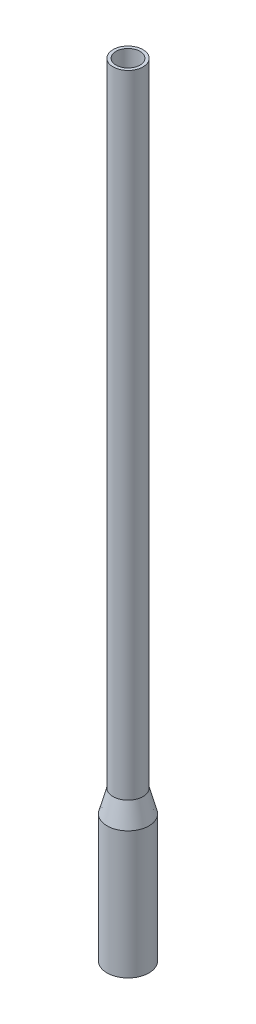
ISO-10303-21;
HEADER;
FILE_DESCRIPTION(('STEP AP214'),'2;1');
FILE_NAME('part.step','',(''),(''),'','','');
FILE_SCHEMA(('AUTOMOTIVE_DESIGN { 1 0 10303 214 1 1 1 1 }'));
ENDSEC;
DATA;
#1=APPLICATION_CONTEXT('core data for automotive mechanical design processes');
#2=APPLICATION_PROTOCOL_DEFINITION('international standard','automotive_design',2000,#1);
#3=PRODUCT_CONTEXT('',#1,'mechanical');
#4=PRODUCT('Part','Part','',(#3));
#5=PRODUCT_RELATED_PRODUCT_CATEGORY('part','',(#4));
#6=PRODUCT_DEFINITION_FORMATION('','',#4);
#7=PRODUCT_DEFINITION_CONTEXT('part definition',#1,'design');
#8=PRODUCT_DEFINITION('design','',#6,#7);
#9=PRODUCT_DEFINITION_SHAPE('','',#8);
#10=(LENGTH_UNIT() NAMED_UNIT(*) SI_UNIT(.MILLI.,.METRE.));
#11=(NAMED_UNIT(*) PLANE_ANGLE_UNIT() SI_UNIT($,.RADIAN.));
#12=(NAMED_UNIT(*) SI_UNIT($,.STERADIAN.) SOLID_ANGLE_UNIT());
#13=UNCERTAINTY_MEASURE_WITH_UNIT(LENGTH_MEASURE(1.E-05),#10,'distance_accuracy_value','');
#14=(GEOMETRIC_REPRESENTATION_CONTEXT(3) GLOBAL_UNCERTAINTY_ASSIGNED_CONTEXT((#13)) GLOBAL_UNIT_ASSIGNED_CONTEXT((#10,
#11,#12)) REPRESENTATION_CONTEXT('',''));
#15=CARTESIAN_POINT('',(0.,0.,0.));
#16=DIRECTION('',(0.,0.,1.));
#17=DIRECTION('',(1.,0.,0.));
#18=AXIS2_PLACEMENT_3D('',#15,#16,#17);
#19=CARTESIAN_POINT('',(-50.,2110.,0.));
#20=DIRECTION('',(0.,-1.,0.));
#21=DIRECTION('',(1.,0.,0.));
#22=AXIS2_PLACEMENT_3D('',#19,#20,#21);
#23=PLANE('',#22);
#24=CARTESIAN_POINT('',(0.,2110.,0.));
#25=DIRECTION('',(0.,-1.,0.));
#26=DIRECTION('',(1.,0.,0.));
#27=AXIS2_PLACEMENT_3D('',#24,#25,#26);
#28=CIRCLE('',#27,50.);
#29=CARTESIAN_POINT('',(50.,2110.,0.));
#30=VERTEX_POINT('',#29);
#31=EDGE_CURVE('E12',#30,#30,#28,.T.);
#32=ORIENTED_EDGE('',*,*,#31,.F.);
#33=EDGE_LOOP('',(#32));
#34=FACE_BOUND('',#33,.T.);
#35=CARTESIAN_POINT('',(0.,2110.,0.));
#36=DIRECTION('',(0.,-1.,0.));
#37=DIRECTION('',(1.,0.,0.));
#38=AXIS2_PLACEMENT_3D('',#35,#36,#37);
#39=CIRCLE('',#38,40.);
#40=CARTESIAN_POINT('',(40.,2110.,0.));
#41=VERTEX_POINT('',#40);
#42=EDGE_CURVE('E70',#41,#41,#39,.T.);
#43=ORIENTED_EDGE('',*,*,#42,.T.);
#44=EDGE_LOOP('',(#43));
#45=FACE_BOUND('',#44,.T.);
#46=ADVANCED_FACE('F42',(#34,#45),#23,.F.);
#47=CARTESIAN_POINT('',(0.,0.,0.));
#48=DIRECTION('',(0.,-1.,0.));
#49=DIRECTION('',(1.,0.,0.));
#50=AXIS2_PLACEMENT_3D('',#47,#48,#49);
#51=CYLINDRICAL_SURFACE('',#50,50.);
#52=CARTESIAN_POINT('',(0.,0.,0.));
#53=DIRECTION('',(0.,-1.,0.));
#54=DIRECTION('',(1.,0.,0.));
#55=AXIS2_PLACEMENT_3D('',#52,#53,#54);
#56=CIRCLE('',#55,50.);
#57=CARTESIAN_POINT('',(50.,0.,0.));
#58=VERTEX_POINT('',#57);
#59=EDGE_CURVE('E48',#58,#58,#56,.T.);
#60=ORIENTED_EDGE('',*,*,#59,.F.);
#61=EDGE_LOOP('',(#60));
#62=FACE_BOUND('',#61,.T.);
#63=ORIENTED_EDGE('',*,*,#31,.T.);
#64=EDGE_LOOP('',(#63));
#65=FACE_BOUND('',#64,.T.);
#66=ADVANCED_FACE('F107',(#62,#65),#51,.T.);
#67=CARTESIAN_POINT('',(0.,0.,0.));
#68=DIRECTION('',(0.,-1.,0.));
#69=DIRECTION('',(1.,0.,0.));
#70=AXIS2_PLACEMENT_3D('',#67,#68,#69);
#71=CONICAL_SURFACE('',#70,50.,0.26179938779915);
#72=CARTESIAN_POINT('',(0.,-74.6410161513774,0.));
#73=DIRECTION('',(0.,-1.,0.));
#74=DIRECTION('',(1.,0.,0.));
#75=AXIS2_PLACEMENT_3D('',#72,#73,#74);
#76=CIRCLE('',#75,70.);
#77=CARTESIAN_POINT('',(70.,-74.6410161513774,0.));
#78=VERTEX_POINT('',#77);
#79=EDGE_CURVE('E52',#78,#78,#76,.T.);
#80=ORIENTED_EDGE('',*,*,#79,.F.);
#81=EDGE_LOOP('',(#80));
#82=FACE_BOUND('',#81,.T.);
#83=ORIENTED_EDGE('',*,*,#59,.T.);
#84=EDGE_LOOP('',(#83));
#85=FACE_BOUND('',#84,.T.);
#86=ADVANCED_FACE('F102',(#82,#85),#71,.T.);
#87=CARTESIAN_POINT('',(0.,0.,0.));
#88=DIRECTION('',(0.,-1.,0.));
#89=DIRECTION('',(1.,0.,0.));
#90=AXIS2_PLACEMENT_3D('',#87,#88,#89);
#91=CYLINDRICAL_SURFACE('',#90,70.);
#92=CARTESIAN_POINT('',(0.,-500.,0.));
#93=DIRECTION('',(0.,-1.,0.));
#94=DIRECTION('',(1.,0.,0.));
#95=AXIS2_PLACEMENT_3D('',#92,#93,#94);
#96=CIRCLE('',#95,70.);
#97=CARTESIAN_POINT('',(70.,-500.,0.));
#98=VERTEX_POINT('',#97);
#99=EDGE_CURVE('E56',#98,#98,#96,.T.);
#100=ORIENTED_EDGE('',*,*,#99,.F.);
#101=EDGE_LOOP('',(#100));
#102=FACE_BOUND('',#101,.T.);
#103=ORIENTED_EDGE('',*,*,#79,.T.);
#104=EDGE_LOOP('',(#103));
#105=FACE_BOUND('',#104,.T.);
#106=ADVANCED_FACE('F96',(#102,#105),#91,.T.);
#107=CARTESIAN_POINT('',(-70.,-500.,0.));
#108=DIRECTION('',(0.,1.,0.));
#109=DIRECTION('',(-1.,0.,0.));
#110=AXIS2_PLACEMENT_3D('',#107,#108,#109);
#111=PLANE('',#110);
#112=CARTESIAN_POINT('',(0.,-500.,0.));
#113=DIRECTION('',(0.,-1.,0.));
#114=DIRECTION('',(1.,0.,0.));
#115=AXIS2_PLACEMENT_3D('',#112,#113,#114);
#116=CIRCLE('',#115,60.);
#117=CARTESIAN_POINT('',(60.,-500.,0.));
#118=VERTEX_POINT('',#117);
#119=EDGE_CURVE('E61',#118,#118,#116,.T.);
#120=ORIENTED_EDGE('',*,*,#119,.F.);
#121=EDGE_LOOP('',(#120));
#122=FACE_BOUND('',#121,.T.);
#123=ORIENTED_EDGE('',*,*,#99,.T.);
#124=EDGE_LOOP('',(#123));
#125=FACE_BOUND('',#124,.T.);
#126=ADVANCED_FACE('F90',(#122,#125),#111,.F.);
#127=CARTESIAN_POINT('',(0.,0.,0.));
#128=DIRECTION('',(0.,-1.,0.));
#129=DIRECTION('',(1.,0.,0.));
#130=AXIS2_PLACEMENT_3D('',#127,#128,#129);
#131=CYLINDRICAL_SURFACE('',#130,60.);
#132=CARTESIAN_POINT('',(0.,-75.9575411272513,0.));
#133=DIRECTION('',(0.,-1.,0.));
#134=DIRECTION('',(1.,0.,0.));
#135=AXIS2_PLACEMENT_3D('',#132,#133,#134);
#136=CIRCLE('',#135,60.);
#137=CARTESIAN_POINT('',(60.,-75.9575411272513,0.));
#138=VERTEX_POINT('',#137);
#139=EDGE_CURVE('E64',#138,#138,#136,.T.);
#140=ORIENTED_EDGE('',*,*,#139,.F.);
#141=EDGE_LOOP('',(#140));
#142=FACE_BOUND('',#141,.T.);
#143=ORIENTED_EDGE('',*,*,#119,.T.);
#144=EDGE_LOOP('',(#143));
#145=FACE_BOUND('',#144,.T.);
#146=ADVANCED_FACE('F84',(#142,#145),#131,.F.);
#147=CARTESIAN_POINT('',(0.,-75.9575411272513,0.));
#148=DIRECTION('',(0.,-1.,0.));
#149=DIRECTION('',(1.,0.,0.));
#150=AXIS2_PLACEMENT_3D('',#147,#148,#149);
#151=CONICAL_SURFACE('',#150,60.,0.26179938779915);
#152=CARTESIAN_POINT('',(0.,-1.31652497587398,0.));
#153=DIRECTION('',(0.,-1.,0.));
#154=DIRECTION('',(1.,0.,0.));
#155=AXIS2_PLACEMENT_3D('',#152,#153,#154);
#156=CIRCLE('',#155,40.);
#157=CARTESIAN_POINT('',(40.,-1.31652497587398,0.));
#158=VERTEX_POINT('',#157);
#159=EDGE_CURVE('E67',#158,#158,#156,.T.);
#160=ORIENTED_EDGE('',*,*,#159,.F.);
#161=EDGE_LOOP('',(#160));
#162=FACE_BOUND('',#161,.T.);
#163=ORIENTED_EDGE('',*,*,#139,.T.);
#164=EDGE_LOOP('',(#163));
#165=FACE_BOUND('',#164,.T.);
#166=ADVANCED_FACE('F78',(#162,#165),#151,.F.);
#167=CARTESIAN_POINT('',(0.,0.,0.));
#168=DIRECTION('',(0.,-1.,0.));
#169=DIRECTION('',(1.,0.,0.));
#170=AXIS2_PLACEMENT_3D('',#167,#168,#169);
#171=CYLINDRICAL_SURFACE('',#170,40.);
#172=ORIENTED_EDGE('',*,*,#42,.F.);
#173=EDGE_LOOP('',(#172));
#174=FACE_BOUND('',#173,.T.);
#175=ORIENTED_EDGE('',*,*,#159,.T.);
#176=EDGE_LOOP('',(#175));
#177=FACE_BOUND('',#176,.T.);
#178=ADVANCED_FACE('F75',(#174,#177),#171,.F.);
#179=CLOSED_SHELL('',(#46,#66,#86,#106,#126,#146,#166,#178));
#180=MANIFOLD_SOLID_BREP('B2',#179);
#181=ADVANCED_BREP_SHAPE_REPRESENTATION('',(#18,#180),#14);
#182=SHAPE_DEFINITION_REPRESENTATION(#9,#181);
ENDSEC;
END-ISO-10303-21;
